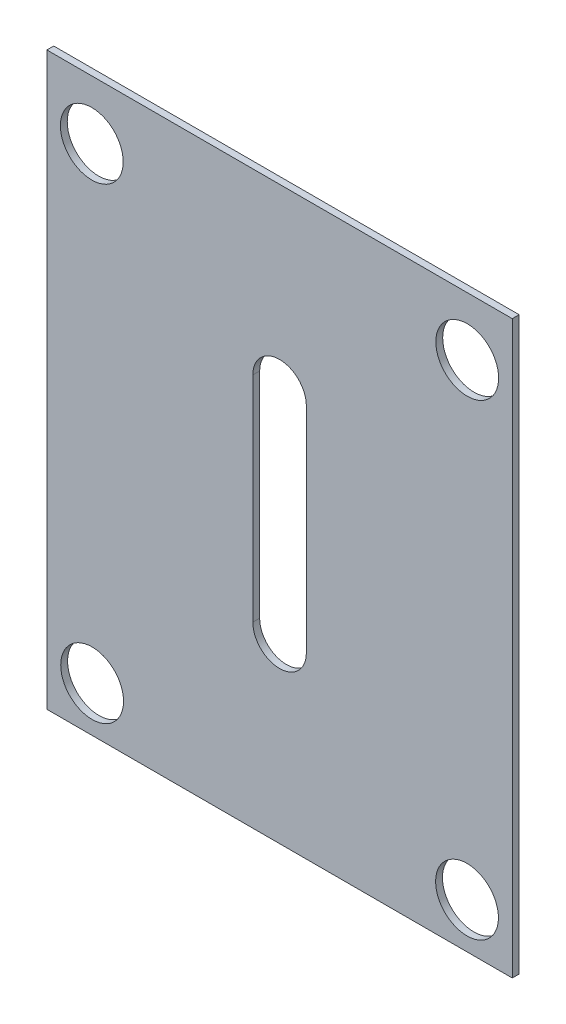
ISO-10303-21;
HEADER;
FILE_DESCRIPTION(('STEP AP214'),'2;1');
FILE_NAME('part.step','',(''),(''),'','','');
FILE_SCHEMA(('AUTOMOTIVE_DESIGN { 1 0 10303 214 1 1 1 1 }'));
ENDSEC;
DATA;
#1=APPLICATION_CONTEXT('core data for automotive mechanical design processes');
#2=APPLICATION_PROTOCOL_DEFINITION('international standard','automotive_design',2000,#1);
#3=PRODUCT_CONTEXT('',#1,'mechanical');
#4=PRODUCT('Part','Part','',(#3));
#5=PRODUCT_RELATED_PRODUCT_CATEGORY('part','',(#4));
#6=PRODUCT_DEFINITION_FORMATION('','',#4);
#7=PRODUCT_DEFINITION_CONTEXT('part definition',#1,'design');
#8=PRODUCT_DEFINITION('design','',#6,#7);
#9=PRODUCT_DEFINITION_SHAPE('','',#8);
#10=(LENGTH_UNIT() NAMED_UNIT(*) SI_UNIT(.MILLI.,.METRE.));
#11=(NAMED_UNIT(*) PLANE_ANGLE_UNIT() SI_UNIT($,.RADIAN.));
#12=(NAMED_UNIT(*) SI_UNIT($,.STERADIAN.) SOLID_ANGLE_UNIT());
#13=UNCERTAINTY_MEASURE_WITH_UNIT(LENGTH_MEASURE(1.E-05),#10,'distance_accuracy_value','');
#14=(GEOMETRIC_REPRESENTATION_CONTEXT(3) GLOBAL_UNCERTAINTY_ASSIGNED_CONTEXT((#13)) GLOBAL_UNIT_ASSIGNED_CONTEXT((#10,
#11,#12)) REPRESENTATION_CONTEXT('',''));
#15=CARTESIAN_POINT('',(0.,0.,0.));
#16=DIRECTION('',(0.,0.,1.));
#17=DIRECTION('',(1.,0.,0.));
#18=AXIS2_PLACEMENT_3D('',#15,#16,#17);
#19=CARTESIAN_POINT('',(-4656.66193548389,-4345.85806451614,0.6096));
#20=DIRECTION('',(1.,0.,0.));
#21=DIRECTION('',(0.,0.,-1.));
#22=AXIS2_PLACEMENT_3D('',#19,#20,#21);
#23=PLANE('',#22);
#24=DIRECTION('',(0.,-1.,0.));
#25=VECTOR('',#24,1.);
#26=CARTESIAN_POINT('',(-4656.66193548389,-4345.85806451614,0.));
#27=LINE('',#26,#25);
#28=CARTESIAN_POINT('',(-4656.66193548389,-4345.85806451614,0.));
#29=VERTEX_POINT('',#28);
#30=CARTESIAN_POINT('',(-4656.66193548389,-4396.65806451614,0.));
#31=VERTEX_POINT('',#30);
#32=EDGE_CURVE('E194',#29,#31,#27,.T.);
#33=ORIENTED_EDGE('',*,*,#32,.T.);
#34=DIRECTION('',(0.,0.,-1.));
#35=VECTOR('',#34,1.);
#36=CARTESIAN_POINT('',(-4656.66193548389,-4396.65806451614,0.6096));
#37=LINE('',#36,#35);
#38=CARTESIAN_POINT('',(-4656.66193548389,-4396.65806451614,0.6096));
#39=VERTEX_POINT('',#38);
#40=EDGE_CURVE('E12',#39,#31,#37,.T.);
#41=ORIENTED_EDGE('',*,*,#40,.F.);
#42=DIRECTION('',(0.,-1.,0.));
#43=VECTOR('',#42,1.);
#44=CARTESIAN_POINT('',(-4656.66193548389,-4345.85806451614,0.6096));
#45=LINE('',#44,#43);
#46=CARTESIAN_POINT('',(-4656.66193548389,-4345.85806451614,0.6096));
#47=VERTEX_POINT('',#46);
#48=EDGE_CURVE('E146',#47,#39,#45,.T.);
#49=ORIENTED_EDGE('',*,*,#48,.F.);
#50=DIRECTION('',(0.,0.,-1.));
#51=VECTOR('',#50,1.);
#52=CARTESIAN_POINT('',(-4656.66193548389,-4345.85806451614,0.6096));
#53=LINE('',#52,#51);
#54=EDGE_CURVE('E175',#47,#29,#53,.T.);
#55=ORIENTED_EDGE('',*,*,#54,.T.);
#56=EDGE_LOOP('',(#33,#41,#49,#55));
#57=FACE_BOUND('',#56,.T.);
#58=ADVANCED_FACE('F45',(#57),#23,.F.);
#59=CARTESIAN_POINT('',(-4656.66193548389,-4396.65806451614,0.6096));
#60=DIRECTION('',(0.,1.,0.));
#61=DIRECTION('',(0.,0.,1.));
#62=AXIS2_PLACEMENT_3D('',#59,#60,#61);
#63=PLANE('',#62);
#64=DIRECTION('',(1.,0.,0.));
#65=VECTOR('',#64,1.);
#66=CARTESIAN_POINT('',(-4656.66193548389,-4396.65806451614,0.));
#67=LINE('',#66,#65);
#68=CARTESIAN_POINT('',(-4615.26193548389,-4396.65806451614,0.));
#69=VERTEX_POINT('',#68);
#70=EDGE_CURVE('E173',#31,#69,#67,.T.);
#71=ORIENTED_EDGE('',*,*,#70,.T.);
#72=DIRECTION('',(0.,0.,-1.));
#73=VECTOR('',#72,1.);
#74=CARTESIAN_POINT('',(-4615.26193548389,-4396.65806451614,0.6096));
#75=LINE('',#74,#73);
#76=CARTESIAN_POINT('',(-4615.26193548389,-4396.65806451614,0.6096));
#77=VERTEX_POINT('',#76);
#78=EDGE_CURVE('E53',#77,#69,#75,.T.);
#79=ORIENTED_EDGE('',*,*,#78,.F.);
#80=DIRECTION('',(1.,0.,0.));
#81=VECTOR('',#80,1.);
#82=CARTESIAN_POINT('',(-4656.66193548389,-4396.65806451614,0.6096));
#83=LINE('',#82,#81);
#84=EDGE_CURVE('E151',#39,#77,#83,.T.);
#85=ORIENTED_EDGE('',*,*,#84,.F.);
#86=ORIENTED_EDGE('',*,*,#40,.T.);
#87=EDGE_LOOP('',(#71,#79,#85,#86));
#88=FACE_BOUND('',#87,.T.);
#89=ADVANCED_FACE('F202',(#88),#63,.F.);
#90=CARTESIAN_POINT('',(-4615.26193548389,-4345.85806451614,0.6096));
#91=DIRECTION('',(-1.,0.,0.));
#92=DIRECTION('',(0.,0.,1.));
#93=AXIS2_PLACEMENT_3D('',#90,#91,#92);
#94=PLANE('',#93);
#95=DIRECTION('',(0.,1.,0.));
#96=VECTOR('',#95,1.);
#97=CARTESIAN_POINT('',(-4615.26193548389,-4345.85806451614,0.));
#98=LINE('',#97,#96);
#99=CARTESIAN_POINT('',(-4615.26193548389,-4345.85806451614,0.));
#100=VERTEX_POINT('',#99);
#101=EDGE_CURVE('E170',#69,#100,#98,.T.);
#102=ORIENTED_EDGE('',*,*,#101,.T.);
#103=DIRECTION('',(0.,0.,-1.));
#104=VECTOR('',#103,1.);
#105=CARTESIAN_POINT('',(-4615.26193548389,-4345.85806451614,0.6096));
#106=LINE('',#105,#104);
#107=CARTESIAN_POINT('',(-4615.26193548389,-4345.85806451614,0.6096));
#108=VERTEX_POINT('',#107);
#109=EDGE_CURVE('E178',#108,#100,#106,.T.);
#110=ORIENTED_EDGE('',*,*,#109,.F.);
#111=DIRECTION('',(0.,1.,0.));
#112=VECTOR('',#111,1.);
#113=CARTESIAN_POINT('',(-4615.26193548389,-4345.85806451614,0.6096));
#114=LINE('',#113,#112);
#115=EDGE_CURVE('E157',#77,#108,#114,.T.);
#116=ORIENTED_EDGE('',*,*,#115,.F.);
#117=ORIENTED_EDGE('',*,*,#78,.T.);
#118=EDGE_LOOP('',(#102,#110,#116,#117));
#119=FACE_BOUND('',#118,.T.);
#120=ADVANCED_FACE('F186',(#119),#94,.F.);
#121=CARTESIAN_POINT('',(-4656.66193548389,-4345.85806451614,0.6096));
#122=DIRECTION('',(0.,-1.,0.));
#123=DIRECTION('',(0.,0.,-1.));
#124=AXIS2_PLACEMENT_3D('',#121,#122,#123);
#125=PLANE('',#124);
#126=DIRECTION('',(-1.,0.,0.));
#127=VECTOR('',#126,1.);
#128=CARTESIAN_POINT('',(-4656.66193548389,-4345.85806451614,0.));
#129=LINE('',#128,#127);
#130=EDGE_CURVE('E152',#100,#29,#129,.T.);
#131=ORIENTED_EDGE('',*,*,#130,.T.);
#132=ORIENTED_EDGE('',*,*,#54,.F.);
#133=DIRECTION('',(-1.,0.,0.));
#134=VECTOR('',#133,1.);
#135=CARTESIAN_POINT('',(-4656.66193548389,-4345.85806451614,0.6096));
#136=LINE('',#135,#134);
#137=EDGE_CURVE('E160',#108,#47,#136,.T.);
#138=ORIENTED_EDGE('',*,*,#137,.F.);
#139=ORIENTED_EDGE('',*,*,#109,.T.);
#140=EDGE_LOOP('',(#131,#132,#138,#139));
#141=FACE_BOUND('',#140,.T.);
#142=ADVANCED_FACE('F197',(#141),#125,.F.);
#143=CARTESIAN_POINT('',(0.,0.,0.6096));
#144=DIRECTION('',(0.,0.,1.));
#145=DIRECTION('',(1.,0.,0.));
#146=AXIS2_PLACEMENT_3D('',#143,#144,#145);
#147=PLANE('',#146);
#148=CARTESIAN_POINT('',(-4652.66720428705,-4351.08887163425,0.6096));
#149=DIRECTION('',(0.,0.,1.));
#150=DIRECTION('',(1.,0.,0.));
#151=AXIS2_PLACEMENT_3D('',#148,#149,#150);
#152=CIRCLE('',#151,2.79399999986852);
#153=CARTESIAN_POINT('',(-4649.87320428718,-4351.08887163425,0.6096));
#154=VERTEX_POINT('',#153);
#155=EDGE_CURVE('E219',#154,#154,#152,.F.);
#156=ORIENTED_EDGE('',*,*,#155,.T.);
#157=EDGE_LOOP('',(#156));
#158=FACE_BOUND('',#157,.T.);
#159=CARTESIAN_POINT('',(-4619.28588451959,-4392.63411548044,0.6096));
#160=DIRECTION('',(0.,0.,1.));
#161=DIRECTION('',(1.,0.,0.));
#162=AXIS2_PLACEMENT_3D('',#159,#160,#161);
#163=CIRCLE('',#162,2.79399999986852);
#164=CARTESIAN_POINT('',(-4616.49188451972,-4392.63411548044,0.6096));
#165=VERTEX_POINT('',#164);
#166=EDGE_CURVE('E222',#165,#165,#163,.F.);
#167=ORIENTED_EDGE('',*,*,#166,.T.);
#168=EDGE_LOOP('',(#167));
#169=FACE_BOUND('',#168,.T.);
#170=CARTESIAN_POINT('',(-4652.63798644819,-4392.63411548044,0.6096));
#171=DIRECTION('',(0.,0.,1.));
#172=DIRECTION('',(1.,0.,0.));
#173=AXIS2_PLACEMENT_3D('',#170,#171,#172);
#174=CIRCLE('',#173,2.79399999986852);
#175=CARTESIAN_POINT('',(-4649.84398644832,-4392.63411548044,0.6096));
#176=VERTEX_POINT('',#175);
#177=EDGE_CURVE('E229',#176,#176,#174,.F.);
#178=ORIENTED_EDGE('',*,*,#177,.T.);
#179=EDGE_LOOP('',(#178));
#180=FACE_BOUND('',#179,.T.);
#181=CARTESIAN_POINT('',(-4619.26723429189,-4351.04410197732,0.6096));
#182=DIRECTION('',(0.,0.,1.));
#183=DIRECTION('',(1.,0.,0.));
#184=AXIS2_PLACEMENT_3D('',#181,#182,#183);
#185=CIRCLE('',#184,2.79399999986571);
#186=CARTESIAN_POINT('',(-4616.47323429202,-4351.04410197732,0.6096));
#187=VERTEX_POINT('',#186);
#188=EDGE_CURVE('E212',#187,#187,#185,.F.);
#189=ORIENTED_EDGE('',*,*,#188,.T.);
#190=EDGE_LOOP('',(#189));
#191=FACE_BOUND('',#190,.T.);
#192=CARTESIAN_POINT('',(-4635.96193548389,-4380.78306451614,0.6096));
#193=DIRECTION('',(0.,0.,1.));
#194=DIRECTION('',(1.,0.,0.));
#195=AXIS2_PLACEMENT_3D('',#192,#193,#194);
#196=CIRCLE('',#195,2.38125);
#197=CARTESIAN_POINT('',(-4638.34318548389,-4380.78306451614,0.6096));
#198=VERTEX_POINT('',#197);
#199=CARTESIAN_POINT('',(-4633.58068548389,-4380.78306451614,0.6096));
#200=VERTEX_POINT('',#199);
#201=EDGE_CURVE('E60',#198,#200,#196,.T.);
#202=ORIENTED_EDGE('',*,*,#201,.F.);
#203=DIRECTION('',(0.,-1.,0.));
#204=VECTOR('',#203,1.);
#205=CARTESIAN_POINT('',(-4638.34318548389,-4380.78306451614,0.6096));
#206=LINE('',#205,#204);
#207=CARTESIAN_POINT('',(-4638.34318548389,-4361.73306451614,0.6096));
#208=VERTEX_POINT('',#207);
#209=EDGE_CURVE('E129',#208,#198,#206,.T.);
#210=ORIENTED_EDGE('',*,*,#209,.F.);
#211=CARTESIAN_POINT('',(-4635.96193548389,-4361.73306451614,0.6096));
#212=DIRECTION('',(0.,0.,1.));
#213=DIRECTION('',(1.,0.,0.));
#214=AXIS2_PLACEMENT_3D('',#211,#212,#213);
#215=CIRCLE('',#214,2.38125);
#216=CARTESIAN_POINT('',(-4633.58068548389,-4361.73306451614,0.6096));
#217=VERTEX_POINT('',#216);
#218=EDGE_CURVE('E113',#217,#208,#215,.T.);
#219=ORIENTED_EDGE('',*,*,#218,.F.);
#220=DIRECTION('',(0.,1.,0.));
#221=VECTOR('',#220,1.);
#222=CARTESIAN_POINT('',(-4633.58068548389,-4380.78306451614,0.6096));
#223=LINE('',#222,#221);
#224=EDGE_CURVE('E122',#200,#217,#223,.T.);
#225=ORIENTED_EDGE('',*,*,#224,.F.);
#226=EDGE_LOOP('',(#202,#210,#219,#225));
#227=FACE_BOUND('',#226,.T.);
#228=ORIENTED_EDGE('',*,*,#48,.T.);
#229=ORIENTED_EDGE('',*,*,#84,.T.);
#230=ORIENTED_EDGE('',*,*,#115,.T.);
#231=ORIENTED_EDGE('',*,*,#137,.T.);
#232=EDGE_LOOP('',(#228,#229,#230,#231));
#233=FACE_BOUND('',#232,.T.);
#234=ADVANCED_FACE('F126',(#158,#169,#180,#191,#227,#233),#147,.T.);
#235=CARTESIAN_POINT('',(0.,0.,0.));
#236=DIRECTION('',(0.,0.,1.));
#237=DIRECTION('',(1.,0.,0.));
#238=AXIS2_PLACEMENT_3D('',#235,#236,#237);
#239=PLANE('',#238);
#240=CARTESIAN_POINT('',(-4652.66720428705,-4351.08887163425,0.));
#241=DIRECTION('',(0.,0.,-1.));
#242=DIRECTION('',(-1.,0.,0.));
#243=AXIS2_PLACEMENT_3D('',#240,#241,#242);
#244=CIRCLE('',#243,2.79399999986852);
#245=CARTESIAN_POINT('',(-4655.46120428692,-4351.08887163425,0.));
#246=VERTEX_POINT('',#245);
#247=EDGE_CURVE('E225',#246,#246,#244,.T.);
#248=ORIENTED_EDGE('',*,*,#247,.F.);
#249=EDGE_LOOP('',(#248));
#250=FACE_BOUND('',#249,.T.);
#251=CARTESIAN_POINT('',(-4619.28588451959,-4392.63411548044,0.));
#252=DIRECTION('',(0.,0.,-1.));
#253=DIRECTION('',(-1.,0.,0.));
#254=AXIS2_PLACEMENT_3D('',#251,#252,#253);
#255=CIRCLE('',#254,2.79399999986852);
#256=CARTESIAN_POINT('',(-4622.07988451946,-4392.63411548044,0.));
#257=VERTEX_POINT('',#256);
#258=EDGE_CURVE('E226',#257,#257,#255,.T.);
#259=ORIENTED_EDGE('',*,*,#258,.F.);
#260=EDGE_LOOP('',(#259));
#261=FACE_BOUND('',#260,.T.);
#262=CARTESIAN_POINT('',(-4652.63798644819,-4392.63411548044,0.));
#263=DIRECTION('',(0.,0.,-1.));
#264=DIRECTION('',(-1.,0.,0.));
#265=AXIS2_PLACEMENT_3D('',#262,#263,#264);
#266=CIRCLE('',#265,2.79399999986852);
#267=CARTESIAN_POINT('',(-4655.43198644806,-4392.63411548044,0.));
#268=VERTEX_POINT('',#267);
#269=EDGE_CURVE('E236',#268,#268,#266,.T.);
#270=ORIENTED_EDGE('',*,*,#269,.F.);
#271=EDGE_LOOP('',(#270));
#272=FACE_BOUND('',#271,.T.);
#273=CARTESIAN_POINT('',(-4619.26723429189,-4351.04410197732,0.));
#274=DIRECTION('',(0.,0.,-1.));
#275=DIRECTION('',(-1.,0.,0.));
#276=AXIS2_PLACEMENT_3D('',#273,#274,#275);
#277=CIRCLE('',#276,2.79399999986571);
#278=CARTESIAN_POINT('',(-4622.06123429175,-4351.04410197732,0.));
#279=VERTEX_POINT('',#278);
#280=EDGE_CURVE('E214',#279,#279,#277,.T.);
#281=ORIENTED_EDGE('',*,*,#280,.F.);
#282=EDGE_LOOP('',(#281));
#283=FACE_BOUND('',#282,.T.);
#284=DIRECTION('',(0.,1.,0.));
#285=VECTOR('',#284,1.);
#286=CARTESIAN_POINT('',(-4638.34318548389,-4380.78306451614,0.));
#287=LINE('',#286,#285);
#288=CARTESIAN_POINT('',(-4638.34318548389,-4380.78306451614,0.));
#289=VERTEX_POINT('',#288);
#290=CARTESIAN_POINT('',(-4638.34318548389,-4361.73306451614,0.));
#291=VERTEX_POINT('',#290);
#292=EDGE_CURVE('E205',#289,#291,#287,.T.);
#293=ORIENTED_EDGE('',*,*,#292,.F.);
#294=CARTESIAN_POINT('',(-4635.96193548389,-4380.78306451614,0.));
#295=DIRECTION('',(0.,0.,1.));
#296=DIRECTION('',(1.,0.,0.));
#297=AXIS2_PLACEMENT_3D('',#294,#295,#296);
#298=CIRCLE('',#297,2.38125);
#299=CARTESIAN_POINT('',(-4633.58068548389,-4380.78306451614,0.));
#300=VERTEX_POINT('',#299);
#301=EDGE_CURVE('E203',#300,#289,#298,.F.);
#302=ORIENTED_EDGE('',*,*,#301,.F.);
#303=DIRECTION('',(0.,-1.,0.));
#304=VECTOR('',#303,1.);
#305=CARTESIAN_POINT('',(-4633.58068548389,-4380.78306451614,0.));
#306=LINE('',#305,#304);
#307=CARTESIAN_POINT('',(-4633.58068548389,-4361.73306451614,0.));
#308=VERTEX_POINT('',#307);
#309=EDGE_CURVE('E153',#308,#300,#306,.T.);
#310=ORIENTED_EDGE('',*,*,#309,.F.);
#311=CARTESIAN_POINT('',(-4635.96193548389,-4361.73306451614,0.));
#312=DIRECTION('',(0.,0.,1.));
#313=DIRECTION('',(1.,0.,0.));
#314=AXIS2_PLACEMENT_3D('',#311,#312,#313);
#315=CIRCLE('',#314,2.38125);
#316=EDGE_CURVE('E116',#291,#308,#315,.F.);
#317=ORIENTED_EDGE('',*,*,#316,.F.);
#318=EDGE_LOOP('',(#293,#302,#310,#317));
#319=FACE_BOUND('',#318,.T.);
#320=ORIENTED_EDGE('',*,*,#32,.F.);
#321=ORIENTED_EDGE('',*,*,#130,.F.);
#322=ORIENTED_EDGE('',*,*,#101,.F.);
#323=ORIENTED_EDGE('',*,*,#70,.F.);
#324=EDGE_LOOP('',(#320,#321,#322,#323));
#325=FACE_BOUND('',#324,.T.);
#326=ADVANCED_FACE('F192',(#250,#261,#272,#283,#319,#325),#239,.F.);
#327=CARTESIAN_POINT('',(-4635.96193548389,-4380.78306451614,-24.2840804334857));
#328=DIRECTION('',(0.,0.,1.));
#329=DIRECTION('',(1.,0.,0.));
#330=AXIS2_PLACEMENT_3D('',#327,#328,#329);
#331=CYLINDRICAL_SURFACE('',#330,2.38125);
#332=ORIENTED_EDGE('',*,*,#301,.T.);
#333=DIRECTION('',(0.,0.,1.));
#334=VECTOR('',#333,1.);
#335=CARTESIAN_POINT('',(-4638.34318548389,-4380.78306451614,-24.2840804334857));
#336=LINE('',#335,#334);
#337=EDGE_CURVE('E134',#289,#198,#336,.T.);
#338=ORIENTED_EDGE('',*,*,#337,.T.);
#339=ORIENTED_EDGE('',*,*,#201,.T.);
#340=DIRECTION('',(0.,0.,1.));
#341=VECTOR('',#340,1.);
#342=CARTESIAN_POINT('',(-4633.58068548389,-4380.78306451614,-24.2840804334857));
#343=LINE('',#342,#341);
#344=EDGE_CURVE('E119',#300,#200,#343,.T.);
#345=ORIENTED_EDGE('',*,*,#344,.F.);
#346=EDGE_LOOP('',(#332,#338,#339,#345));
#347=FACE_BOUND('',#346,.T.);
#348=ADVANCED_FACE('F245',(#347),#331,.F.);
#349=CARTESIAN_POINT('',(-4638.34318548389,-4380.78306451614,-24.2840804334857));
#350=DIRECTION('',(-1.,0.,0.));
#351=DIRECTION('',(0.,0.,1.));
#352=AXIS2_PLACEMENT_3D('',#349,#350,#351);
#353=PLANE('',#352);
#354=ORIENTED_EDGE('',*,*,#292,.T.);
#355=DIRECTION('',(0.,0.,1.));
#356=VECTOR('',#355,1.);
#357=CARTESIAN_POINT('',(-4638.34318548389,-4361.73306451614,-24.2840804334857));
#358=LINE('',#357,#356);
#359=EDGE_CURVE('E118',#291,#208,#358,.T.);
#360=ORIENTED_EDGE('',*,*,#359,.T.);
#361=ORIENTED_EDGE('',*,*,#209,.T.);
#362=ORIENTED_EDGE('',*,*,#337,.F.);
#363=EDGE_LOOP('',(#354,#360,#361,#362));
#364=FACE_BOUND('',#363,.T.);
#365=ADVANCED_FACE('F252',(#364),#353,.F.);
#366=CARTESIAN_POINT('',(-4635.96193548389,-4361.73306451614,-24.2840804334857));
#367=DIRECTION('',(0.,0.,1.));
#368=DIRECTION('',(1.,0.,0.));
#369=AXIS2_PLACEMENT_3D('',#366,#367,#368);
#370=CYLINDRICAL_SURFACE('',#369,2.38125);
#371=ORIENTED_EDGE('',*,*,#316,.T.);
#372=DIRECTION('',(0.,0.,1.));
#373=VECTOR('',#372,1.);
#374=CARTESIAN_POINT('',(-4633.58068548389,-4361.73306451614,-24.2840804334857));
#375=LINE('',#374,#373);
#376=EDGE_CURVE('E68',#308,#217,#375,.T.);
#377=ORIENTED_EDGE('',*,*,#376,.T.);
#378=ORIENTED_EDGE('',*,*,#218,.T.);
#379=ORIENTED_EDGE('',*,*,#359,.F.);
#380=EDGE_LOOP('',(#371,#377,#378,#379));
#381=FACE_BOUND('',#380,.T.);
#382=ADVANCED_FACE('F110',(#381),#370,.F.);
#383=CARTESIAN_POINT('',(-4633.58068548389,-4380.78306451614,-24.2840804334857));
#384=DIRECTION('',(1.,0.,0.));
#385=DIRECTION('',(0.,0.,-1.));
#386=AXIS2_PLACEMENT_3D('',#383,#384,#385);
#387=PLANE('',#386);
#388=ORIENTED_EDGE('',*,*,#309,.T.);
#389=ORIENTED_EDGE('',*,*,#344,.T.);
#390=ORIENTED_EDGE('',*,*,#224,.T.);
#391=ORIENTED_EDGE('',*,*,#376,.F.);
#392=EDGE_LOOP('',(#388,#389,#390,#391));
#393=FACE_BOUND('',#392,.T.);
#394=ADVANCED_FACE('F123',(#393),#387,.F.);
#395=CARTESIAN_POINT('',(-4619.26723429189,-4351.04410197732,8.51222538616832));
#396=DIRECTION('',(0.,0.,-1.));
#397=DIRECTION('',(-1.,0.,0.));
#398=AXIS2_PLACEMENT_3D('',#395,#396,#397);
#399=CYLINDRICAL_SURFACE('',#398,2.79399999986571);
#400=ORIENTED_EDGE('',*,*,#280,.T.);
#401=EDGE_LOOP('',(#400));
#402=FACE_BOUND('',#401,.T.);
#403=ORIENTED_EDGE('',*,*,#188,.F.);
#404=EDGE_LOOP('',(#403));
#405=FACE_BOUND('',#404,.T.);
#406=ADVANCED_FACE('F283',(#402,#405),#399,.F.);
#407=CARTESIAN_POINT('',(-4652.63798644819,-4392.63411548044,8.51222538616832));
#408=DIRECTION('',(0.,0.,-1.));
#409=DIRECTION('',(-1.,0.,0.));
#410=AXIS2_PLACEMENT_3D('',#407,#408,#409);
#411=CYLINDRICAL_SURFACE('',#410,2.79399999986852);
#412=ORIENTED_EDGE('',*,*,#269,.T.);
#413=EDGE_LOOP('',(#412));
#414=FACE_BOUND('',#413,.T.);
#415=ORIENTED_EDGE('',*,*,#177,.F.);
#416=EDGE_LOOP('',(#415));
#417=FACE_BOUND('',#416,.T.);
#418=ADVANCED_FACE('F240',(#414,#417),#411,.F.);
#419=CARTESIAN_POINT('',(-4619.28588451959,-4392.63411548044,8.51222538616832));
#420=DIRECTION('',(0.,0.,-1.));
#421=DIRECTION('',(-1.,0.,0.));
#422=AXIS2_PLACEMENT_3D('',#419,#420,#421);
#423=CYLINDRICAL_SURFACE('',#422,2.79399999986852);
#424=ORIENTED_EDGE('',*,*,#258,.T.);
#425=EDGE_LOOP('',(#424));
#426=FACE_BOUND('',#425,.T.);
#427=ORIENTED_EDGE('',*,*,#166,.F.);
#428=EDGE_LOOP('',(#427));
#429=FACE_BOUND('',#428,.T.);
#430=ADVANCED_FACE('F282',(#426,#429),#423,.F.);
#431=CARTESIAN_POINT('',(-4652.66720428705,-4351.08887163425,8.51222538616832));
#432=DIRECTION('',(0.,0.,-1.));
#433=DIRECTION('',(-1.,0.,0.));
#434=AXIS2_PLACEMENT_3D('',#431,#432,#433);
#435=CYLINDRICAL_SURFACE('',#434,2.79399999986852);
#436=ORIENTED_EDGE('',*,*,#247,.T.);
#437=EDGE_LOOP('',(#436));
#438=FACE_BOUND('',#437,.T.);
#439=ORIENTED_EDGE('',*,*,#155,.F.);
#440=EDGE_LOOP('',(#439));
#441=FACE_BOUND('',#440,.T.);
#442=ADVANCED_FACE('F289',(#438,#441),#435,.F.);
#443=CLOSED_SHELL('',(#58,#89,#120,#142,#234,#326,#348,#365,#382,#394,#406,#418,#430,#442));
#444=MANIFOLD_SOLID_BREP('B2',#443);
#445=ADVANCED_BREP_SHAPE_REPRESENTATION('',(#18,#444),#14);
#446=SHAPE_DEFINITION_REPRESENTATION(#9,#445);
ENDSEC;
END-ISO-10303-21;
